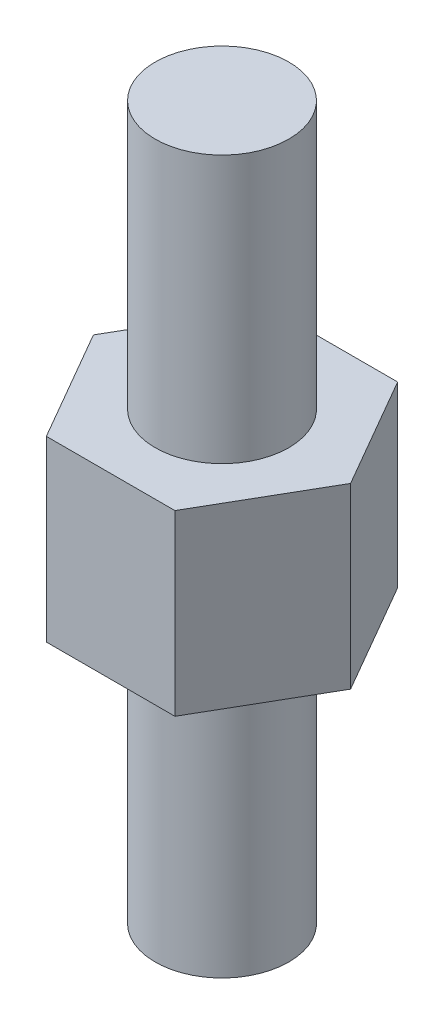
ISO-10303-21;
HEADER;
FILE_DESCRIPTION(('STEP AP214'),'2;1');
FILE_NAME('part.step','',(''),(''),'','','');
FILE_SCHEMA(('AUTOMOTIVE_DESIGN { 1 0 10303 214 1 1 1 1 }'));
ENDSEC;
DATA;
#1=APPLICATION_CONTEXT('core data for automotive mechanical design processes');
#2=APPLICATION_PROTOCOL_DEFINITION('international standard','automotive_design',2000,#1);
#3=PRODUCT_CONTEXT('',#1,'mechanical');
#4=PRODUCT('Part','Part','',(#3));
#5=PRODUCT_RELATED_PRODUCT_CATEGORY('part','',(#4));
#6=PRODUCT_DEFINITION_FORMATION('','',#4);
#7=PRODUCT_DEFINITION_CONTEXT('part definition',#1,'design');
#8=PRODUCT_DEFINITION('design','',#6,#7);
#9=PRODUCT_DEFINITION_SHAPE('','',#8);
#10=(LENGTH_UNIT() NAMED_UNIT(*) SI_UNIT(.MILLI.,.METRE.));
#11=(NAMED_UNIT(*) PLANE_ANGLE_UNIT() SI_UNIT($,.RADIAN.));
#12=(NAMED_UNIT(*) SI_UNIT($,.STERADIAN.) SOLID_ANGLE_UNIT());
#13=UNCERTAINTY_MEASURE_WITH_UNIT(LENGTH_MEASURE(1.E-05),#10,'distance_accuracy_value','');
#14=(GEOMETRIC_REPRESENTATION_CONTEXT(3) GLOBAL_UNCERTAINTY_ASSIGNED_CONTEXT((#13)) GLOBAL_UNIT_ASSIGNED_CONTEXT((#10,
#11,#12)) REPRESENTATION_CONTEXT('',''));
#15=CARTESIAN_POINT('',(0.,0.,0.));
#16=DIRECTION('',(0.,0.,1.));
#17=DIRECTION('',(1.,0.,0.));
#18=AXIS2_PLACEMENT_3D('',#15,#16,#17);
#19=CARTESIAN_POINT('',(0.,-6.,0.));
#20=DIRECTION('',(0.,-1.,0.));
#21=DIRECTION('',(1.,0.,0.));
#22=AXIS2_PLACEMENT_3D('',#19,#20,#21);
#23=PLANE('',#22);
#24=CARTESIAN_POINT('',(0.,-6.,0.));
#25=DIRECTION('',(0.,-1.,0.));
#26=DIRECTION('',(1.,0.,0.));
#27=AXIS2_PLACEMENT_3D('',#24,#25,#26);
#28=CIRCLE('',#27,1.5);
#29=CARTESIAN_POINT('',(1.5,-6.,0.));
#30=VERTEX_POINT('',#29);
#31=EDGE_CURVE('E19',#30,#30,#28,.F.);
#32=ORIENTED_EDGE('',*,*,#31,.F.);
#33=EDGE_LOOP('',(#32));
#34=FACE_BOUND('',#33,.T.);
#35=ADVANCED_FACE('F16',(#34),#23,.T.);
#36=CARTESIAN_POINT('',(0.,-3.,0.));
#37=DIRECTION('',(0.,-1.,0.));
#38=DIRECTION('',(1.,0.,0.));
#39=AXIS2_PLACEMENT_3D('',#36,#37,#38);
#40=CYLINDRICAL_SURFACE('',#39,1.5);
#41=CARTESIAN_POINT('',(0.,0.,0.));
#42=DIRECTION('',(0.,-1.,0.));
#43=DIRECTION('',(1.,0.,0.));
#44=AXIS2_PLACEMENT_3D('',#41,#42,#43);
#45=CIRCLE('',#44,1.5);
#46=CARTESIAN_POINT('',(1.5,0.,0.));
#47=VERTEX_POINT('',#46);
#48=EDGE_CURVE('E85',#47,#47,#45,.T.);
#49=ORIENTED_EDGE('',*,*,#48,.T.);
#50=EDGE_LOOP('',(#49));
#51=FACE_BOUND('',#50,.T.);
#52=ORIENTED_EDGE('',*,*,#31,.T.);
#53=EDGE_LOOP('',(#52));
#54=FACE_BOUND('',#53,.T.);
#55=ADVANCED_FACE('F104',(#51,#54),#40,.T.);
#56=CARTESIAN_POINT('',(0.,0.,0.));
#57=DIRECTION('',(0.,1.,0.));
#58=DIRECTION('',(0.,0.,1.));
#59=AXIS2_PLACEMENT_3D('',#56,#57,#58);
#60=PLANE('',#59);
#61=ORIENTED_EDGE('',*,*,#48,.F.);
#62=EDGE_LOOP('',(#61));
#63=FACE_BOUND('',#62,.T.);
#64=DIRECTION('',(-0.500000000000001,0.,-0.866025403784438));
#65=VECTOR('',#64,1.);
#66=CARTESIAN_POINT('',(2.88675134594813,0.,0.));
#67=LINE('',#66,#65);
#68=CARTESIAN_POINT('',(2.88675134594813,0.,0.));
#69=VERTEX_POINT('',#68);
#70=CARTESIAN_POINT('',(1.44337567297406,0.,-2.5));
#71=VERTEX_POINT('',#70);
#72=EDGE_CURVE('E242',#69,#71,#67,.T.);
#73=ORIENTED_EDGE('',*,*,#72,.F.);
#74=DIRECTION('',(0.499999999999999,0.,-0.866025403784439));
#75=VECTOR('',#74,1.);
#76=CARTESIAN_POINT('',(1.44337567297407,0.,2.5));
#77=LINE('',#76,#75);
#78=CARTESIAN_POINT('',(1.44337567297407,0.,2.5));
#79=VERTEX_POINT('',#78);
#80=EDGE_CURVE('E247',#79,#69,#77,.T.);
#81=ORIENTED_EDGE('',*,*,#80,.F.);
#82=DIRECTION('',(1.,0.,0.));
#83=VECTOR('',#82,1.);
#84=CARTESIAN_POINT('',(-1.44337567297406,0.,2.5));
#85=LINE('',#84,#83);
#86=CARTESIAN_POINT('',(-1.44337567297406,0.,2.5));
#87=VERTEX_POINT('',#86);
#88=EDGE_CURVE('E250',#87,#79,#85,.T.);
#89=ORIENTED_EDGE('',*,*,#88,.F.);
#90=DIRECTION('',(0.500000000000001,0.,0.866025403784438));
#91=VECTOR('',#90,1.);
#92=CARTESIAN_POINT('',(-2.88675134594813,0.,0.));
#93=LINE('',#92,#91);
#94=CARTESIAN_POINT('',(-2.88675134594813,0.,0.));
#95=VERTEX_POINT('',#94);
#96=EDGE_CURVE('E67',#95,#87,#93,.T.);
#97=ORIENTED_EDGE('',*,*,#96,.F.);
#98=DIRECTION('',(-0.5,0.,0.866025403784439));
#99=VECTOR('',#98,1.);
#100=CARTESIAN_POINT('',(-1.44337567297406,0.,-2.5));
#101=LINE('',#100,#99);
#102=CARTESIAN_POINT('',(-1.44337567297406,0.,-2.5));
#103=VERTEX_POINT('',#102);
#104=EDGE_CURVE('E69',#103,#95,#101,.T.);
#105=ORIENTED_EDGE('',*,*,#104,.F.);
#106=DIRECTION('',(-1.,0.,0.));
#107=VECTOR('',#106,1.);
#108=CARTESIAN_POINT('',(1.44337567297406,0.,-2.5));
#109=LINE('',#108,#107);
#110=EDGE_CURVE('E72',#71,#103,#109,.T.);
#111=ORIENTED_EDGE('',*,*,#110,.F.);
#112=EDGE_LOOP('',(#73,#81,#89,#97,#105,#111));
#113=FACE_BOUND('',#112,.T.);
#114=ADVANCED_FACE('F71',(#63,#113),#60,.F.);
#115=CARTESIAN_POINT('',(1.44337567297406,0.,-2.5));
#116=DIRECTION('',(0.,0.,-1.));
#117=DIRECTION('',(-1.,0.,0.));
#118=AXIS2_PLACEMENT_3D('',#115,#116,#117);
#119=PLANE('',#118);
#120=DIRECTION('',(1.,0.,0.));
#121=VECTOR('',#120,1.);
#122=CARTESIAN_POINT('',(0.,4.,-2.5));
#123=LINE('',#122,#121);
#124=CARTESIAN_POINT('',(1.44337567297406,4.,-2.5));
#125=VERTEX_POINT('',#124);
#126=CARTESIAN_POINT('',(-1.44337567297406,4.,-2.5));
#127=VERTEX_POINT('',#126);
#128=EDGE_CURVE('E235',#125,#127,#123,.F.);
#129=ORIENTED_EDGE('',*,*,#128,.F.);
#130=DIRECTION('',(0.,1.,0.));
#131=VECTOR('',#130,1.);
#132=CARTESIAN_POINT('',(1.44337567297406,0.,-2.5));
#133=LINE('',#132,#131);
#134=EDGE_CURVE('E83',#71,#125,#133,.T.);
#135=ORIENTED_EDGE('',*,*,#134,.F.);
#136=ORIENTED_EDGE('',*,*,#110,.T.);
#137=DIRECTION('',(0.,1.,0.));
#138=VECTOR('',#137,1.);
#139=CARTESIAN_POINT('',(-1.44337567297406,0.,-2.5));
#140=LINE('',#139,#138);
#141=EDGE_CURVE('E77',#127,#103,#140,.F.);
#142=ORIENTED_EDGE('',*,*,#141,.F.);
#143=EDGE_LOOP('',(#129,#135,#136,#142));
#144=FACE_BOUND('',#143,.T.);
#145=ADVANCED_FACE('F80',(#144),#119,.T.);
#146=CARTESIAN_POINT('',(-1.44337567297406,0.,-2.5));
#147=DIRECTION('',(-0.866025403784439,0.,-0.5));
#148=DIRECTION('',(-0.5,0.,0.866025403784439));
#149=AXIS2_PLACEMENT_3D('',#146,#147,#148);
#150=PLANE('',#149);
#151=DIRECTION('',(-0.500000000000001,0.,0.866025403784438));
#152=VECTOR('',#151,1.);
#153=CARTESIAN_POINT('',(-1.44337567297406,4.,-2.5));
#154=LINE('',#153,#152);
#155=CARTESIAN_POINT('',(-2.88675134594813,4.,0.));
#156=VERTEX_POINT('',#155);
#157=EDGE_CURVE('E89',#127,#156,#154,.T.);
#158=ORIENTED_EDGE('',*,*,#157,.F.);
#159=ORIENTED_EDGE('',*,*,#141,.T.);
#160=ORIENTED_EDGE('',*,*,#104,.T.);
#161=DIRECTION('',(0.,1.,0.));
#162=VECTOR('',#161,1.);
#163=CARTESIAN_POINT('',(-2.88675134594813,0.,0.));
#164=LINE('',#163,#162);
#165=EDGE_CURVE('E92',#156,#95,#164,.F.);
#166=ORIENTED_EDGE('',*,*,#165,.F.);
#167=EDGE_LOOP('',(#158,#159,#160,#166));
#168=FACE_BOUND('',#167,.T.);
#169=ADVANCED_FACE('F87',(#168),#150,.T.);
#170=CARTESIAN_POINT('',(-2.88675134594813,0.,0.));
#171=DIRECTION('',(-0.866025403784438,0.,0.500000000000001));
#172=DIRECTION('',(0.500000000000001,0.,0.866025403784438));
#173=AXIS2_PLACEMENT_3D('',#170,#171,#172);
#174=PLANE('',#173);
#175=DIRECTION('',(0.500000000000002,0.,0.866025403784438));
#176=VECTOR('',#175,1.);
#177=CARTESIAN_POINT('',(-2.88675134594813,4.,0.));
#178=LINE('',#177,#176);
#179=CARTESIAN_POINT('',(-1.44337567297406,4.,2.5));
#180=VERTEX_POINT('',#179);
#181=EDGE_CURVE('E225',#156,#180,#178,.T.);
#182=ORIENTED_EDGE('',*,*,#181,.F.);
#183=ORIENTED_EDGE('',*,*,#165,.T.);
#184=ORIENTED_EDGE('',*,*,#96,.T.);
#185=DIRECTION('',(0.,1.,0.));
#186=VECTOR('',#185,1.);
#187=CARTESIAN_POINT('',(-1.44337567297406,0.,2.5));
#188=LINE('',#187,#186);
#189=EDGE_CURVE('E227',#180,#87,#188,.F.);
#190=ORIENTED_EDGE('',*,*,#189,.F.);
#191=EDGE_LOOP('',(#182,#183,#184,#190));
#192=FACE_BOUND('',#191,.T.);
#193=ADVANCED_FACE('F137',(#192),#174,.T.);
#194=CARTESIAN_POINT('',(-1.44337567297406,0.,2.5));
#195=DIRECTION('',(0.,0.,1.));
#196=DIRECTION('',(1.,0.,0.));
#197=AXIS2_PLACEMENT_3D('',#194,#195,#196);
#198=PLANE('',#197);
#199=DIRECTION('',(1.,0.,0.));
#200=VECTOR('',#199,1.);
#201=CARTESIAN_POINT('',(0.,4.,2.5));
#202=LINE('',#201,#200);
#203=CARTESIAN_POINT('',(1.44337567297407,4.,2.5));
#204=VERTEX_POINT('',#203);
#205=EDGE_CURVE('E231',#180,#204,#202,.T.);
#206=ORIENTED_EDGE('',*,*,#205,.F.);
#207=ORIENTED_EDGE('',*,*,#189,.T.);
#208=ORIENTED_EDGE('',*,*,#88,.T.);
#209=DIRECTION('',(0.,1.,0.));
#210=VECTOR('',#209,1.);
#211=CARTESIAN_POINT('',(1.44337567297407,0.,2.5));
#212=LINE('',#211,#210);
#213=EDGE_CURVE('E244',#204,#79,#212,.F.);
#214=ORIENTED_EDGE('',*,*,#213,.F.);
#215=EDGE_LOOP('',(#206,#207,#208,#214));
#216=FACE_BOUND('',#215,.T.);
#217=ADVANCED_FACE('F134',(#216),#198,.T.);
#218=CARTESIAN_POINT('',(1.44337567297407,0.,2.5));
#219=DIRECTION('',(0.866025403784439,0.,0.499999999999999));
#220=DIRECTION('',(0.499999999999999,0.,-0.866025403784439));
#221=AXIS2_PLACEMENT_3D('',#218,#219,#220);
#222=PLANE('',#221);
#223=DIRECTION('',(0.499999999999998,0.,-0.86602540378444));
#224=VECTOR('',#223,1.);
#225=CARTESIAN_POINT('',(1.44337567297407,4.,2.5));
#226=LINE('',#225,#224);
#227=CARTESIAN_POINT('',(2.88675134594813,4.,0.));
#228=VERTEX_POINT('',#227);
#229=EDGE_CURVE('E252',#204,#228,#226,.T.);
#230=ORIENTED_EDGE('',*,*,#229,.F.);
#231=ORIENTED_EDGE('',*,*,#213,.T.);
#232=ORIENTED_EDGE('',*,*,#80,.T.);
#233=DIRECTION('',(0.,1.,0.));
#234=VECTOR('',#233,1.);
#235=CARTESIAN_POINT('',(2.88675134594813,0.,0.));
#236=LINE('',#235,#234);
#237=EDGE_CURVE('E34',#228,#69,#236,.F.);
#238=ORIENTED_EDGE('',*,*,#237,.F.);
#239=EDGE_LOOP('',(#230,#231,#232,#238));
#240=FACE_BOUND('',#239,.T.);
#241=ADVANCED_FACE('F130',(#240),#222,.T.);
#242=CARTESIAN_POINT('',(2.88675134594813,0.,0.));
#243=DIRECTION('',(0.866025403784438,0.,-0.500000000000001));
#244=DIRECTION('',(-0.500000000000001,0.,-0.866025403784438));
#245=AXIS2_PLACEMENT_3D('',#242,#243,#244);
#246=PLANE('',#245);
#247=DIRECTION('',(-0.500000000000002,0.,-0.866025403784438));
#248=VECTOR('',#247,1.);
#249=CARTESIAN_POINT('',(2.88675134594813,4.,0.));
#250=LINE('',#249,#248);
#251=EDGE_CURVE('E97',#228,#125,#250,.T.);
#252=ORIENTED_EDGE('',*,*,#251,.F.);
#253=ORIENTED_EDGE('',*,*,#237,.T.);
#254=ORIENTED_EDGE('',*,*,#72,.T.);
#255=ORIENTED_EDGE('',*,*,#134,.T.);
#256=EDGE_LOOP('',(#252,#253,#254,#255));
#257=FACE_BOUND('',#256,.T.);
#258=ADVANCED_FACE('F126',(#257),#246,.T.);
#259=CARTESIAN_POINT('',(0.,4.,0.));
#260=DIRECTION('',(0.,1.,0.));
#261=DIRECTION('',(0.,0.,1.));
#262=AXIS2_PLACEMENT_3D('',#259,#260,#261);
#263=PLANE('',#262);
#264=CARTESIAN_POINT('',(0.,4.,0.));
#265=DIRECTION('',(0.,-1.,0.));
#266=DIRECTION('',(1.,0.,0.));
#267=AXIS2_PLACEMENT_3D('',#264,#265,#266);
#268=CIRCLE('',#267,1.5);
#269=CARTESIAN_POINT('',(1.5,4.,0.));
#270=VERTEX_POINT('',#269);
#271=EDGE_CURVE('E25',#270,#270,#268,.F.);
#272=ORIENTED_EDGE('',*,*,#271,.F.);
#273=EDGE_LOOP('',(#272));
#274=FACE_BOUND('',#273,.T.);
#275=ORIENTED_EDGE('',*,*,#229,.T.);
#276=ORIENTED_EDGE('',*,*,#251,.T.);
#277=ORIENTED_EDGE('',*,*,#128,.T.);
#278=ORIENTED_EDGE('',*,*,#157,.T.);
#279=ORIENTED_EDGE('',*,*,#181,.T.);
#280=ORIENTED_EDGE('',*,*,#205,.T.);
#281=EDGE_LOOP('',(#275,#276,#277,#278,#279,#280));
#282=FACE_BOUND('',#281,.T.);
#283=ADVANCED_FACE('F119',(#274,#282),#263,.T.);
#284=CARTESIAN_POINT('',(1.5,10.,0.));
#285=DIRECTION('',(0.,1.,0.));
#286=DIRECTION('',(-1.,0.,0.));
#287=AXIS2_PLACEMENT_3D('',#284,#285,#286);
#288=PLANE('',#287);
#289=CARTESIAN_POINT('',(0.,10.,0.));
#290=DIRECTION('',(0.,-1.,0.));
#291=DIRECTION('',(1.,0.,0.));
#292=AXIS2_PLACEMENT_3D('',#289,#290,#291);
#293=CIRCLE('',#292,1.5);
#294=CARTESIAN_POINT('',(1.5,10.,0.));
#295=VERTEX_POINT('',#294);
#296=EDGE_CURVE('E11',#295,#295,#293,.T.);
#297=ORIENTED_EDGE('',*,*,#296,.F.);
#298=EDGE_LOOP('',(#297));
#299=FACE_BOUND('',#298,.T.);
#300=ADVANCED_FACE('F113',(#299),#288,.T.);
#301=CARTESIAN_POINT('',(0.,7.00000000000001,0.));
#302=DIRECTION('',(0.,-1.,0.));
#303=DIRECTION('',(1.,0.,0.));
#304=AXIS2_PLACEMENT_3D('',#301,#302,#303);
#305=CYLINDRICAL_SURFACE('',#304,1.5);
#306=ORIENTED_EDGE('',*,*,#296,.T.);
#307=EDGE_LOOP('',(#306));
#308=FACE_BOUND('',#307,.T.);
#309=ORIENTED_EDGE('',*,*,#271,.T.);
#310=EDGE_LOOP('',(#309));
#311=FACE_BOUND('',#310,.T.);
#312=ADVANCED_FACE('F111',(#308,#311),#305,.T.);
#313=CLOSED_SHELL('',(#35,#55,#114,#145,#169,#193,#217,#241,#258,#283,#300,#312));
#314=MANIFOLD_SOLID_BREP('B1',#313);
#315=ADVANCED_BREP_SHAPE_REPRESENTATION('',(#18,#314),#14);
#316=SHAPE_DEFINITION_REPRESENTATION(#9,#315);
ENDSEC;
END-ISO-10303-21;
